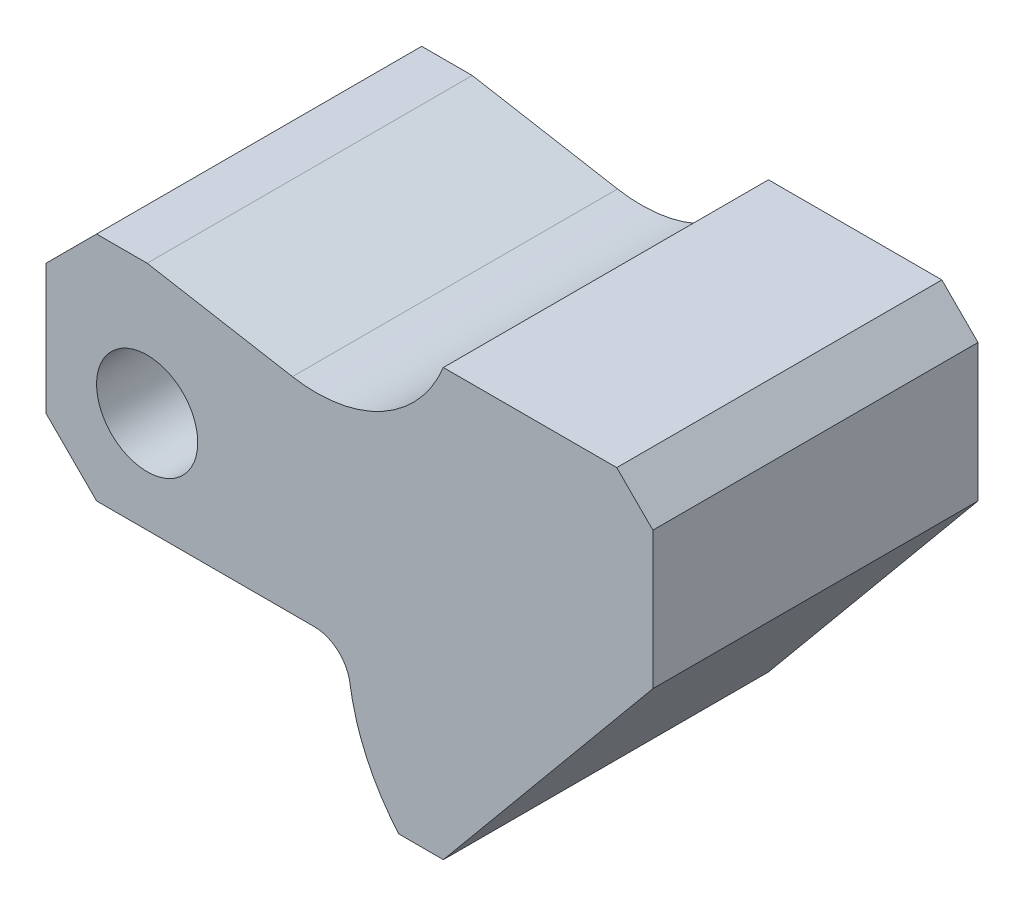
ISO-10303-21;
HEADER;
FILE_DESCRIPTION(('STEP AP214'),'2;1');
FILE_NAME('part.step','',(''),(''),'','','');
FILE_SCHEMA(('AUTOMOTIVE_DESIGN { 1 0 10303 214 1 1 1 1 }'));
ENDSEC;
DATA;
#1=APPLICATION_CONTEXT('core data for automotive mechanical design processes');
#2=APPLICATION_PROTOCOL_DEFINITION('international standard','automotive_design',2000,#1);
#3=PRODUCT_CONTEXT('',#1,'mechanical');
#4=PRODUCT('Part','Part','',(#3));
#5=PRODUCT_RELATED_PRODUCT_CATEGORY('part','',(#4));
#6=PRODUCT_DEFINITION_FORMATION('','',#4);
#7=PRODUCT_DEFINITION_CONTEXT('part definition',#1,'design');
#8=PRODUCT_DEFINITION('design','',#6,#7);
#9=PRODUCT_DEFINITION_SHAPE('','',#8);
#10=(LENGTH_UNIT() NAMED_UNIT(*) SI_UNIT(.MILLI.,.METRE.));
#11=(NAMED_UNIT(*) PLANE_ANGLE_UNIT() SI_UNIT($,.RADIAN.));
#12=(NAMED_UNIT(*) SI_UNIT($,.STERADIAN.) SOLID_ANGLE_UNIT());
#13=UNCERTAINTY_MEASURE_WITH_UNIT(LENGTH_MEASURE(1.E-05),#10,'distance_accuracy_value','');
#14=(GEOMETRIC_REPRESENTATION_CONTEXT(3) GLOBAL_UNCERTAINTY_ASSIGNED_CONTEXT((#13)) GLOBAL_UNIT_ASSIGNED_CONTEXT((#10,
#11,#12)) REPRESENTATION_CONTEXT('',''));
#15=CARTESIAN_POINT('',(0.,0.,0.));
#16=DIRECTION('',(0.,0.,1.));
#17=DIRECTION('',(1.,0.,0.));
#18=AXIS2_PLACEMENT_3D('',#15,#16,#17);
#19=CARTESIAN_POINT('',(23.1125137012567,-19.,45.));
#20=DIRECTION('',(0.,0.,-1.));
#21=DIRECTION('',(-1.,0.,0.));
#22=AXIS2_PLACEMENT_3D('',#19,#20,#21);
#23=PLANE('',#22);
#24=DIRECTION('',(-0.707106781186547,-0.707106781186547,0.));
#25=VECTOR('',#24,1.);
#26=CARTESIAN_POINT('',(-7.00000000000001,18.,45.));
#27=LINE('',#26,#25);
#28=CARTESIAN_POINT('',(-7.00000000000001,18.,45.));
#29=VERTEX_POINT('',#28);
#30=CARTESIAN_POINT('',(-14.,11.,45.));
#31=VERTEX_POINT('',#30);
#32=EDGE_CURVE('E222',#29,#31,#27,.T.);
#33=ORIENTED_EDGE('',*,*,#32,.T.);
#34=DIRECTION('',(0.,-1.,0.));
#35=VECTOR('',#34,1.);
#36=CARTESIAN_POINT('',(-14.,11.,45.));
#37=LINE('',#36,#35);
#38=CARTESIAN_POINT('',(-14.,-7.,45.));
#39=VERTEX_POINT('',#38);
#40=EDGE_CURVE('E122',#31,#39,#37,.T.);
#41=ORIENTED_EDGE('',*,*,#40,.T.);
#42=DIRECTION('',(0.707106781186547,-0.707106781186548,0.));
#43=VECTOR('',#42,1.);
#44=CARTESIAN_POINT('',(-14.,-7.,45.));
#45=LINE('',#44,#43);
#46=CARTESIAN_POINT('',(-7.,-14.,45.));
#47=VERTEX_POINT('',#46);
#48=EDGE_CURVE('E267',#39,#47,#45,.T.);
#49=ORIENTED_EDGE('',*,*,#48,.T.);
#50=DIRECTION('',(1.,0.,0.));
#51=VECTOR('',#50,1.);
#52=CARTESIAN_POINT('',(-7.,-14.,45.));
#53=LINE('',#52,#51);
#54=CARTESIAN_POINT('',(23.1125137012567,-14.,45.));
#55=VERTEX_POINT('',#54);
#56=EDGE_CURVE('E287',#47,#55,#53,.T.);
#57=ORIENTED_EDGE('',*,*,#56,.T.);
#58=CARTESIAN_POINT('',(23.1125137012567,-19.,45.));
#59=DIRECTION('',(0.,0.,-1.));
#60=DIRECTION('',(-1.,0.,0.));
#61=AXIS2_PLACEMENT_3D('',#58,#59,#60);
#62=CIRCLE('',#61,5.);
#63=CARTESIAN_POINT('',(28.0581524426685,-18.2647058823529,45.));
#64=VERTEX_POINT('',#63);
#65=EDGE_CURVE('E283',#55,#64,#62,.T.);
#66=ORIENTED_EDGE('',*,*,#65,.T.);
#67=CARTESIAN_POINT('',(56.7428571428571,-14.,45.));
#68=DIRECTION('',(0.,0.,1.));
#69=DIRECTION('',(1.,0.,0.));
#70=AXIS2_PLACEMENT_3D('',#67,#68,#69);
#71=CIRCLE('',#70,29.);
#72=CARTESIAN_POINT('',(34.8339548426505,-33.,45.));
#73=VERTEX_POINT('',#72);
#74=EDGE_CURVE('E286',#64,#73,#71,.T.);
#75=ORIENTED_EDGE('',*,*,#74,.T.);
#76=DIRECTION('',(1.,0.,0.));
#77=VECTOR('',#76,1.);
#78=CARTESIAN_POINT('',(34.8339548426505,-33.,45.));
#79=LINE('',#78,#77);
#80=CARTESIAN_POINT('',(41.,-33.,45.));
#81=VERTEX_POINT('',#80);
#82=EDGE_CURVE('E291',#73,#81,#79,.T.);
#83=ORIENTED_EDGE('',*,*,#82,.T.);
#84=DIRECTION('',(0.638017864750323,0.770021560905562,0.));
#85=VECTOR('',#84,1.);
#86=CARTESIAN_POINT('',(41.,-33.,45.));
#87=LINE('',#86,#85);
#88=CARTESIAN_POINT('',(70.,2.,45.));
#89=VERTEX_POINT('',#88);
#90=EDGE_CURVE('E298',#81,#89,#87,.T.);
#91=ORIENTED_EDGE('',*,*,#90,.T.);
#92=DIRECTION('',(0.,1.,0.));
#93=VECTOR('',#92,1.);
#94=CARTESIAN_POINT('',(70.,2.,45.));
#95=LINE('',#94,#93);
#96=CARTESIAN_POINT('',(70.,21.,45.));
#97=VERTEX_POINT('',#96);
#98=EDGE_CURVE('E301',#89,#97,#95,.T.);
#99=ORIENTED_EDGE('',*,*,#98,.T.);
#100=DIRECTION('',(-0.707106781186548,0.707106781186547,0.));
#101=VECTOR('',#100,1.);
#102=CARTESIAN_POINT('',(70.,21.,45.));
#103=LINE('',#102,#101);
#104=CARTESIAN_POINT('',(65.,26.,45.));
#105=VERTEX_POINT('',#104);
#106=EDGE_CURVE('E304',#97,#105,#103,.T.);
#107=ORIENTED_EDGE('',*,*,#106,.T.);
#108=DIRECTION('',(-1.,0.,0.));
#109=VECTOR('',#108,1.);
#110=CARTESIAN_POINT('',(65.,26.,45.));
#111=LINE('',#110,#109);
#112=CARTESIAN_POINT('',(41.,26.,45.));
#113=VERTEX_POINT('',#112);
#114=EDGE_CURVE('E159',#105,#113,#111,.T.);
#115=ORIENTED_EDGE('',*,*,#114,.T.);
#116=CARTESIAN_POINT('',(23.4033577276849,33.1664622192664,45.));
#117=DIRECTION('',(0.,0.,-1.));
#118=DIRECTION('',(1.,0.,0.));
#119=AXIS2_PLACEMENT_3D('',#116,#117,#118);
#120=CIRCLE('',#119,19.);
#121=CARTESIAN_POINT('',(20.1040423520132,14.4551149120344,45.));
#122=VERTEX_POINT('',#121);
#123=EDGE_CURVE('E153',#113,#122,#120,.T.);
#124=ORIENTED_EDGE('',*,*,#123,.T.);
#125=DIRECTION('',(-0.984807753012208,0.173648177666931,0.));
#126=VECTOR('',#125,1.);
#127=CARTESIAN_POINT('',(20.1040423520132,14.4551149120344,45.));
#128=LINE('',#127,#126);
#129=CARTESIAN_POINT('',(0.,18.,45.));
#130=VERTEX_POINT('',#129);
#131=EDGE_CURVE('E157',#122,#130,#128,.T.);
#132=ORIENTED_EDGE('',*,*,#131,.T.);
#133=DIRECTION('',(-1.,0.,0.));
#134=VECTOR('',#133,1.);
#135=CARTESIAN_POINT('',(0.,18.,45.));
#136=LINE('',#135,#134);
#137=EDGE_CURVE('E61',#130,#29,#136,.T.);
#138=ORIENTED_EDGE('',*,*,#137,.T.);
#139=EDGE_LOOP('',(#33,#41,#49,#57,#66,#75,#83,#91,#99,#107,#115,#124,#132,#138));
#140=FACE_BOUND('',#139,.T.);
#141=CARTESIAN_POINT('',(0.,0.,45.));
#142=DIRECTION('',(0.,0.,1.));
#143=DIRECTION('',(1.,0.,0.));
#144=AXIS2_PLACEMENT_3D('',#141,#142,#143);
#145=CIRCLE('',#144,7.);
#146=CARTESIAN_POINT('',(7.,0.,45.));
#147=VERTEX_POINT('',#146);
#148=EDGE_CURVE('E186',#147,#147,#145,.T.);
#149=ORIENTED_EDGE('',*,*,#148,.F.);
#150=EDGE_LOOP('',(#149));
#151=FACE_BOUND('',#150,.T.);
#152=ADVANCED_FACE('F43',(#140,#151),#23,.F.);
#153=CARTESIAN_POINT('',(23.1125137012567,-19.,0.));
#154=DIRECTION('',(0.,0.,-1.));
#155=DIRECTION('',(-1.,0.,0.));
#156=AXIS2_PLACEMENT_3D('',#153,#154,#155);
#157=PLANE('',#156);
#158=DIRECTION('',(-0.707106781186547,-0.707106781186547,0.));
#159=VECTOR('',#158,1.);
#160=CARTESIAN_POINT('',(-7.00000000000001,18.,0.));
#161=LINE('',#160,#159);
#162=CARTESIAN_POINT('',(-7.00000000000001,18.,0.));
#163=VERTEX_POINT('',#162);
#164=CARTESIAN_POINT('',(-14.,11.,0.));
#165=VERTEX_POINT('',#164);
#166=EDGE_CURVE('E181',#163,#165,#161,.T.);
#167=ORIENTED_EDGE('',*,*,#166,.F.);
#168=DIRECTION('',(-1.,0.,0.));
#169=VECTOR('',#168,1.);
#170=CARTESIAN_POINT('',(0.,18.,0.));
#171=LINE('',#170,#169);
#172=CARTESIAN_POINT('',(0.,18.,0.));
#173=VERTEX_POINT('',#172);
#174=EDGE_CURVE('E114',#173,#163,#171,.T.);
#175=ORIENTED_EDGE('',*,*,#174,.F.);
#176=DIRECTION('',(-0.984807753012208,0.173648177666931,0.));
#177=VECTOR('',#176,1.);
#178=CARTESIAN_POINT('',(20.1040423520132,14.4551149120344,0.));
#179=LINE('',#178,#177);
#180=CARTESIAN_POINT('',(20.1040423520132,14.4551149120344,0.));
#181=VERTEX_POINT('',#180);
#182=EDGE_CURVE('E108',#181,#173,#179,.T.);
#183=ORIENTED_EDGE('',*,*,#182,.F.);
#184=CARTESIAN_POINT('',(23.4033577276849,33.1664622192664,0.));
#185=DIRECTION('',(0.,0.,-1.));
#186=DIRECTION('',(1.,0.,0.));
#187=AXIS2_PLACEMENT_3D('',#184,#185,#186);
#188=CIRCLE('',#187,19.);
#189=CARTESIAN_POINT('',(41.,26.,0.));
#190=VERTEX_POINT('',#189);
#191=EDGE_CURVE('E168',#190,#181,#188,.T.);
#192=ORIENTED_EDGE('',*,*,#191,.F.);
#193=DIRECTION('',(-1.,0.,0.));
#194=VECTOR('',#193,1.);
#195=CARTESIAN_POINT('',(65.,26.,0.));
#196=LINE('',#195,#194);
#197=CARTESIAN_POINT('',(65.,26.,0.));
#198=VERTEX_POINT('',#197);
#199=EDGE_CURVE('E213',#198,#190,#196,.T.);
#200=ORIENTED_EDGE('',*,*,#199,.F.);
#201=DIRECTION('',(-0.707106781186548,0.707106781186547,0.));
#202=VECTOR('',#201,1.);
#203=CARTESIAN_POINT('',(70.,21.,0.));
#204=LINE('',#203,#202);
#205=CARTESIAN_POINT('',(70.,21.,0.));
#206=VERTEX_POINT('',#205);
#207=EDGE_CURVE('E210',#206,#198,#204,.T.);
#208=ORIENTED_EDGE('',*,*,#207,.F.);
#209=DIRECTION('',(0.,1.,0.));
#210=VECTOR('',#209,1.);
#211=CARTESIAN_POINT('',(70.,2.,0.));
#212=LINE('',#211,#210);
#213=CARTESIAN_POINT('',(70.,2.,0.));
#214=VERTEX_POINT('',#213);
#215=EDGE_CURVE('E207',#214,#206,#212,.T.);
#216=ORIENTED_EDGE('',*,*,#215,.F.);
#217=DIRECTION('',(0.638017864750323,0.770021560905562,0.));
#218=VECTOR('',#217,1.);
#219=CARTESIAN_POINT('',(41.,-33.,0.));
#220=LINE('',#219,#218);
#221=CARTESIAN_POINT('',(41.,-33.,0.));
#222=VERTEX_POINT('',#221);
#223=EDGE_CURVE('E204',#222,#214,#220,.T.);
#224=ORIENTED_EDGE('',*,*,#223,.F.);
#225=DIRECTION('',(1.,0.,0.));
#226=VECTOR('',#225,1.);
#227=CARTESIAN_POINT('',(34.8339548426505,-33.,0.));
#228=LINE('',#227,#226);
#229=CARTESIAN_POINT('',(34.8339548426505,-33.,0.));
#230=VERTEX_POINT('',#229);
#231=EDGE_CURVE('E201',#230,#222,#228,.T.);
#232=ORIENTED_EDGE('',*,*,#231,.F.);
#233=CARTESIAN_POINT('',(56.7428571428571,-14.,0.));
#234=DIRECTION('',(0.,0.,1.));
#235=DIRECTION('',(1.,0.,0.));
#236=AXIS2_PLACEMENT_3D('',#233,#234,#235);
#237=CIRCLE('',#236,29.);
#238=CARTESIAN_POINT('',(28.0581524426685,-18.2647058823529,0.));
#239=VERTEX_POINT('',#238);
#240=EDGE_CURVE('E198',#239,#230,#237,.T.);
#241=ORIENTED_EDGE('',*,*,#240,.F.);
#242=CARTESIAN_POINT('',(23.1125137012567,-19.,0.));
#243=DIRECTION('',(0.,0.,-1.));
#244=DIRECTION('',(-1.,0.,0.));
#245=AXIS2_PLACEMENT_3D('',#242,#243,#244);
#246=CIRCLE('',#245,5.);
#247=CARTESIAN_POINT('',(23.1125137012567,-14.,0.));
#248=VERTEX_POINT('',#247);
#249=EDGE_CURVE('E195',#248,#239,#246,.T.);
#250=ORIENTED_EDGE('',*,*,#249,.F.);
#251=DIRECTION('',(1.,0.,0.));
#252=VECTOR('',#251,1.);
#253=CARTESIAN_POINT('',(-7.,-14.,0.));
#254=LINE('',#253,#252);
#255=CARTESIAN_POINT('',(-7.,-14.,0.));
#256=VERTEX_POINT('',#255);
#257=EDGE_CURVE('E192',#256,#248,#254,.T.);
#258=ORIENTED_EDGE('',*,*,#257,.F.);
#259=DIRECTION('',(0.707106781186547,-0.707106781186548,0.));
#260=VECTOR('',#259,1.);
#261=CARTESIAN_POINT('',(-14.,-7.,0.));
#262=LINE('',#261,#260);
#263=CARTESIAN_POINT('',(-14.,-7.,0.));
#264=VERTEX_POINT('',#263);
#265=EDGE_CURVE('E189',#264,#256,#262,.T.);
#266=ORIENTED_EDGE('',*,*,#265,.F.);
#267=DIRECTION('',(0.,-1.,0.));
#268=VECTOR('',#267,1.);
#269=CARTESIAN_POINT('',(-14.,11.,0.));
#270=LINE('',#269,#268);
#271=EDGE_CURVE('E185',#165,#264,#270,.T.);
#272=ORIENTED_EDGE('',*,*,#271,.F.);
#273=EDGE_LOOP('',(#167,#175,#183,#192,#200,#208,#216,#224,#232,#241,#250,#258,#266,#272));
#274=FACE_BOUND('',#273,.T.);
#275=CARTESIAN_POINT('',(0.,0.,0.));
#276=DIRECTION('',(0.,0.,1.));
#277=DIRECTION('',(1.,0.,0.));
#278=AXIS2_PLACEMENT_3D('',#275,#276,#277);
#279=CIRCLE('',#278,7.);
#280=CARTESIAN_POINT('',(7.,0.,0.));
#281=VERTEX_POINT('',#280);
#282=EDGE_CURVE('E513',#281,#281,#279,.T.);
#283=ORIENTED_EDGE('',*,*,#282,.T.);
#284=EDGE_LOOP('',(#283));
#285=FACE_BOUND('',#284,.T.);
#286=ADVANCED_FACE('F271',(#274,#285),#157,.T.);
#287=CARTESIAN_POINT('',(-7.00000000000001,18.,45.));
#288=DIRECTION('',(0.707106781186547,-0.707106781186547,0.));
#289=DIRECTION('',(0.707106781186548,0.707106781186548,0.));
#290=AXIS2_PLACEMENT_3D('',#287,#288,#289);
#291=PLANE('',#290);
#292=ORIENTED_EDGE('',*,*,#166,.T.);
#293=DIRECTION('',(0.,0.,-1.));
#294=VECTOR('',#293,1.);
#295=CARTESIAN_POINT('',(-14.,11.,45.));
#296=LINE('',#295,#294);
#297=EDGE_CURVE('E11',#31,#165,#296,.T.);
#298=ORIENTED_EDGE('',*,*,#297,.F.);
#299=ORIENTED_EDGE('',*,*,#32,.F.);
#300=DIRECTION('',(0.,0.,-1.));
#301=VECTOR('',#300,1.);
#302=CARTESIAN_POINT('',(-7.00000000000001,18.,45.));
#303=LINE('',#302,#301);
#304=EDGE_CURVE('E177',#29,#163,#303,.T.);
#305=ORIENTED_EDGE('',*,*,#304,.T.);
#306=EDGE_LOOP('',(#292,#298,#299,#305));
#307=FACE_BOUND('',#306,.T.);
#308=ADVANCED_FACE('F45',(#307),#291,.F.);
#309=CARTESIAN_POINT('',(-14.,11.,45.));
#310=DIRECTION('',(1.,0.,0.));
#311=DIRECTION('',(0.,1.,0.));
#312=AXIS2_PLACEMENT_3D('',#309,#310,#311);
#313=PLANE('',#312);
#314=ORIENTED_EDGE('',*,*,#271,.T.);
#315=DIRECTION('',(0.,0.,-1.));
#316=VECTOR('',#315,1.);
#317=CARTESIAN_POINT('',(-14.,-7.,45.));
#318=LINE('',#317,#316);
#319=EDGE_CURVE('E53',#39,#264,#318,.T.);
#320=ORIENTED_EDGE('',*,*,#319,.F.);
#321=ORIENTED_EDGE('',*,*,#40,.F.);
#322=ORIENTED_EDGE('',*,*,#297,.T.);
#323=EDGE_LOOP('',(#314,#320,#321,#322));
#324=FACE_BOUND('',#323,.T.);
#325=ADVANCED_FACE('F340',(#324),#313,.F.);
#326=CARTESIAN_POINT('',(-14.,-7.,45.));
#327=DIRECTION('',(0.707106781186548,0.707106781186547,0.));
#328=DIRECTION('',(-0.707106781186547,0.707106781186548,0.));
#329=AXIS2_PLACEMENT_3D('',#326,#327,#328);
#330=PLANE('',#329);
#331=ORIENTED_EDGE('',*,*,#265,.T.);
#332=DIRECTION('',(0.,0.,-1.));
#333=VECTOR('',#332,1.);
#334=CARTESIAN_POINT('',(-7.,-14.,45.));
#335=LINE('',#334,#333);
#336=EDGE_CURVE('E257',#47,#256,#335,.T.);
#337=ORIENTED_EDGE('',*,*,#336,.F.);
#338=ORIENTED_EDGE('',*,*,#48,.F.);
#339=ORIENTED_EDGE('',*,*,#319,.T.);
#340=EDGE_LOOP('',(#331,#337,#338,#339));
#341=FACE_BOUND('',#340,.T.);
#342=ADVANCED_FACE('F265',(#341),#330,.F.);
#343=CARTESIAN_POINT('',(-7.,-14.,45.));
#344=DIRECTION('',(0.,1.,0.));
#345=DIRECTION('',(-1.,0.,0.));
#346=AXIS2_PLACEMENT_3D('',#343,#344,#345);
#347=PLANE('',#346);
#348=ORIENTED_EDGE('',*,*,#257,.T.);
#349=DIRECTION('',(0.,0.,-1.));
#350=VECTOR('',#349,1.);
#351=CARTESIAN_POINT('',(23.1125137012567,-14.,45.));
#352=LINE('',#351,#350);
#353=EDGE_CURVE('E253',#55,#248,#352,.T.);
#354=ORIENTED_EDGE('',*,*,#353,.F.);
#355=ORIENTED_EDGE('',*,*,#56,.F.);
#356=ORIENTED_EDGE('',*,*,#336,.T.);
#357=EDGE_LOOP('',(#348,#354,#355,#356));
#358=FACE_BOUND('',#357,.T.);
#359=ADVANCED_FACE('F277',(#358),#347,.F.);
#360=CARTESIAN_POINT('',(23.1125137012567,-19.,45.));
#361=DIRECTION('',(0.,0.,-1.));
#362=DIRECTION('',(-1.,0.,0.));
#363=AXIS2_PLACEMENT_3D('',#360,#361,#362);
#364=CYLINDRICAL_SURFACE('',#363,5.);
#365=ORIENTED_EDGE('',*,*,#249,.T.);
#366=DIRECTION('',(0.,0.,-1.));
#367=VECTOR('',#366,1.);
#368=CARTESIAN_POINT('',(28.0581524426685,-18.2647058823529,45.));
#369=LINE('',#368,#367);
#370=EDGE_CURVE('E249',#64,#239,#369,.T.);
#371=ORIENTED_EDGE('',*,*,#370,.F.);
#372=ORIENTED_EDGE('',*,*,#65,.F.);
#373=ORIENTED_EDGE('',*,*,#353,.T.);
#374=EDGE_LOOP('',(#365,#371,#372,#373));
#375=FACE_BOUND('',#374,.T.);
#376=ADVANCED_FACE('F281',(#375),#364,.F.);
#377=CARTESIAN_POINT('',(56.7428571428571,-14.,45.));
#378=DIRECTION('',(0.,0.,-1.));
#379=DIRECTION('',(-1.,0.,0.));
#380=AXIS2_PLACEMENT_3D('',#377,#378,#379);
#381=CYLINDRICAL_SURFACE('',#380,29.);
#382=ORIENTED_EDGE('',*,*,#240,.T.);
#383=DIRECTION('',(0.,0.,-1.));
#384=VECTOR('',#383,1.);
#385=CARTESIAN_POINT('',(34.8339548426505,-33.,45.));
#386=LINE('',#385,#384);
#387=EDGE_CURVE('E245',#73,#230,#386,.T.);
#388=ORIENTED_EDGE('',*,*,#387,.F.);
#389=ORIENTED_EDGE('',*,*,#74,.F.);
#390=ORIENTED_EDGE('',*,*,#370,.T.);
#391=EDGE_LOOP('',(#382,#388,#389,#390));
#392=FACE_BOUND('',#391,.T.);
#393=ADVANCED_FACE('F353',(#392),#381,.T.);
#394=CARTESIAN_POINT('',(34.8339548426505,-33.,45.));
#395=DIRECTION('',(0.,1.,0.));
#396=DIRECTION('',(0.,0.,1.));
#397=AXIS2_PLACEMENT_3D('',#394,#395,#396);
#398=PLANE('',#397);
#399=ORIENTED_EDGE('',*,*,#231,.T.);
#400=DIRECTION('',(0.,0.,-1.));
#401=VECTOR('',#400,1.);
#402=CARTESIAN_POINT('',(41.,-33.,45.));
#403=LINE('',#402,#401);
#404=EDGE_CURVE('E241',#81,#222,#403,.T.);
#405=ORIENTED_EDGE('',*,*,#404,.F.);
#406=ORIENTED_EDGE('',*,*,#82,.F.);
#407=ORIENTED_EDGE('',*,*,#387,.T.);
#408=EDGE_LOOP('',(#399,#405,#406,#407));
#409=FACE_BOUND('',#408,.T.);
#410=ADVANCED_FACE('F356',(#409),#398,.F.);
#411=CARTESIAN_POINT('',(41.,-33.,45.));
#412=DIRECTION('',(-0.770021560905562,0.638017864750323,0.));
#413=DIRECTION('',(-0.638017864750323,-0.770021560905562,0.));
#414=AXIS2_PLACEMENT_3D('',#411,#412,#413);
#415=PLANE('',#414);
#416=ORIENTED_EDGE('',*,*,#223,.T.);
#417=DIRECTION('',(0.,0.,-1.));
#418=VECTOR('',#417,1.);
#419=CARTESIAN_POINT('',(70.,2.,45.));
#420=LINE('',#419,#418);
#421=EDGE_CURVE('E237',#89,#214,#420,.T.);
#422=ORIENTED_EDGE('',*,*,#421,.F.);
#423=ORIENTED_EDGE('',*,*,#90,.F.);
#424=ORIENTED_EDGE('',*,*,#404,.T.);
#425=EDGE_LOOP('',(#416,#422,#423,#424));
#426=FACE_BOUND('',#425,.T.);
#427=ADVANCED_FACE('F360',(#426),#415,.F.);
#428=CARTESIAN_POINT('',(70.,2.,45.));
#429=DIRECTION('',(-1.,0.,0.));
#430=DIRECTION('',(0.,0.,1.));
#431=AXIS2_PLACEMENT_3D('',#428,#429,#430);
#432=PLANE('',#431);
#433=ORIENTED_EDGE('',*,*,#215,.T.);
#434=DIRECTION('',(0.,0.,-1.));
#435=VECTOR('',#434,1.);
#436=CARTESIAN_POINT('',(70.,21.,45.));
#437=LINE('',#436,#435);
#438=EDGE_CURVE('E233',#97,#206,#437,.T.);
#439=ORIENTED_EDGE('',*,*,#438,.F.);
#440=ORIENTED_EDGE('',*,*,#98,.F.);
#441=ORIENTED_EDGE('',*,*,#421,.T.);
#442=EDGE_LOOP('',(#433,#439,#440,#441));
#443=FACE_BOUND('',#442,.T.);
#444=ADVANCED_FACE('F364',(#443),#432,.F.);
#445=CARTESIAN_POINT('',(70.,21.,45.));
#446=DIRECTION('',(-0.707106781186547,-0.707106781186548,0.));
#447=DIRECTION('',(0.707106781186548,-0.707106781186547,0.));
#448=AXIS2_PLACEMENT_3D('',#445,#446,#447);
#449=PLANE('',#448);
#450=ORIENTED_EDGE('',*,*,#207,.T.);
#451=DIRECTION('',(0.,0.,-1.));
#452=VECTOR('',#451,1.);
#453=CARTESIAN_POINT('',(65.,26.,45.));
#454=LINE('',#453,#452);
#455=EDGE_CURVE('E229',#105,#198,#454,.T.);
#456=ORIENTED_EDGE('',*,*,#455,.F.);
#457=ORIENTED_EDGE('',*,*,#106,.F.);
#458=ORIENTED_EDGE('',*,*,#438,.T.);
#459=EDGE_LOOP('',(#450,#456,#457,#458));
#460=FACE_BOUND('',#459,.T.);
#461=ADVANCED_FACE('F312',(#460),#449,.F.);
#462=CARTESIAN_POINT('',(65.,26.,45.));
#463=DIRECTION('',(0.,-1.,0.));
#464=DIRECTION('',(1.,0.,0.));
#465=AXIS2_PLACEMENT_3D('',#462,#463,#464);
#466=PLANE('',#465);
#467=ORIENTED_EDGE('',*,*,#199,.T.);
#468=DIRECTION('',(0.,0.,-1.));
#469=VECTOR('',#468,1.);
#470=CARTESIAN_POINT('',(41.,26.,45.));
#471=LINE('',#470,#469);
#472=EDGE_CURVE('E170',#113,#190,#471,.T.);
#473=ORIENTED_EDGE('',*,*,#472,.F.);
#474=ORIENTED_EDGE('',*,*,#114,.F.);
#475=ORIENTED_EDGE('',*,*,#455,.T.);
#476=EDGE_LOOP('',(#467,#473,#474,#475));
#477=FACE_BOUND('',#476,.T.);
#478=ADVANCED_FACE('F316',(#477),#466,.F.);
#479=CARTESIAN_POINT('',(23.4033577276849,33.1664622192664,45.));
#480=DIRECTION('',(0.,0.,-1.));
#481=DIRECTION('',(-1.,0.,0.));
#482=AXIS2_PLACEMENT_3D('',#479,#480,#481);
#483=CYLINDRICAL_SURFACE('',#482,19.);
#484=ORIENTED_EDGE('',*,*,#191,.T.);
#485=DIRECTION('',(0.,0.,-1.));
#486=VECTOR('',#485,1.);
#487=CARTESIAN_POINT('',(20.1040423520132,14.4551149120344,45.));
#488=LINE('',#487,#486);
#489=EDGE_CURVE('E165',#122,#181,#488,.T.);
#490=ORIENTED_EDGE('',*,*,#489,.F.);
#491=ORIENTED_EDGE('',*,*,#123,.F.);
#492=ORIENTED_EDGE('',*,*,#472,.T.);
#493=EDGE_LOOP('',(#484,#490,#491,#492));
#494=FACE_BOUND('',#493,.T.);
#495=ADVANCED_FACE('F166',(#494),#483,.F.);
#496=CARTESIAN_POINT('',(20.1040423520132,14.4551149120344,45.));
#497=DIRECTION('',(-0.173648177666931,-0.984807753012208,0.));
#498=DIRECTION('',(0.984807753012208,-0.173648177666931,0.));
#499=AXIS2_PLACEMENT_3D('',#496,#497,#498);
#500=PLANE('',#499);
#501=ORIENTED_EDGE('',*,*,#182,.T.);
#502=DIRECTION('',(0.,0.,-1.));
#503=VECTOR('',#502,1.);
#504=CARTESIAN_POINT('',(0.,18.,45.));
#505=LINE('',#504,#503);
#506=EDGE_CURVE('E171',#130,#173,#505,.T.);
#507=ORIENTED_EDGE('',*,*,#506,.F.);
#508=ORIENTED_EDGE('',*,*,#131,.F.);
#509=ORIENTED_EDGE('',*,*,#489,.T.);
#510=EDGE_LOOP('',(#501,#507,#508,#509));
#511=FACE_BOUND('',#510,.T.);
#512=ADVANCED_FACE('F173',(#511),#500,.F.);
#513=CARTESIAN_POINT('',(0.,18.,45.));
#514=DIRECTION('',(0.,-1.,0.));
#515=DIRECTION('',(1.,0.,0.));
#516=AXIS2_PLACEMENT_3D('',#513,#514,#515);
#517=PLANE('',#516);
#518=ORIENTED_EDGE('',*,*,#174,.T.);
#519=ORIENTED_EDGE('',*,*,#304,.F.);
#520=ORIENTED_EDGE('',*,*,#137,.F.);
#521=ORIENTED_EDGE('',*,*,#506,.T.);
#522=EDGE_LOOP('',(#518,#519,#520,#521));
#523=FACE_BOUND('',#522,.T.);
#524=ADVANCED_FACE('F320',(#523),#517,.F.);
#525=CARTESIAN_POINT('',(0.,0.,45.));
#526=DIRECTION('',(0.,0.,-1.));
#527=DIRECTION('',(-1.,0.,0.));
#528=AXIS2_PLACEMENT_3D('',#525,#526,#527);
#529=CYLINDRICAL_SURFACE('',#528,7.);
#530=ORIENTED_EDGE('',*,*,#148,.T.);
#531=EDGE_LOOP('',(#530));
#532=FACE_BOUND('',#531,.T.);
#533=ORIENTED_EDGE('',*,*,#282,.F.);
#534=EDGE_LOOP('',(#533));
#535=FACE_BOUND('',#534,.T.);
#536=ADVANCED_FACE('F322',(#532,#535),#529,.F.);
#537=CLOSED_SHELL('',(#152,#286,#308,#325,#342,#359,#376,#393,#410,#427,#444,#461,#478,#495,
#512,#524,#536));
#538=MANIFOLD_SOLID_BREP('B2',#537);
#539=ADVANCED_BREP_SHAPE_REPRESENTATION('',(#18,#538),#14);
#540=SHAPE_DEFINITION_REPRESENTATION(#9,#539);
ENDSEC;
END-ISO-10303-21;
